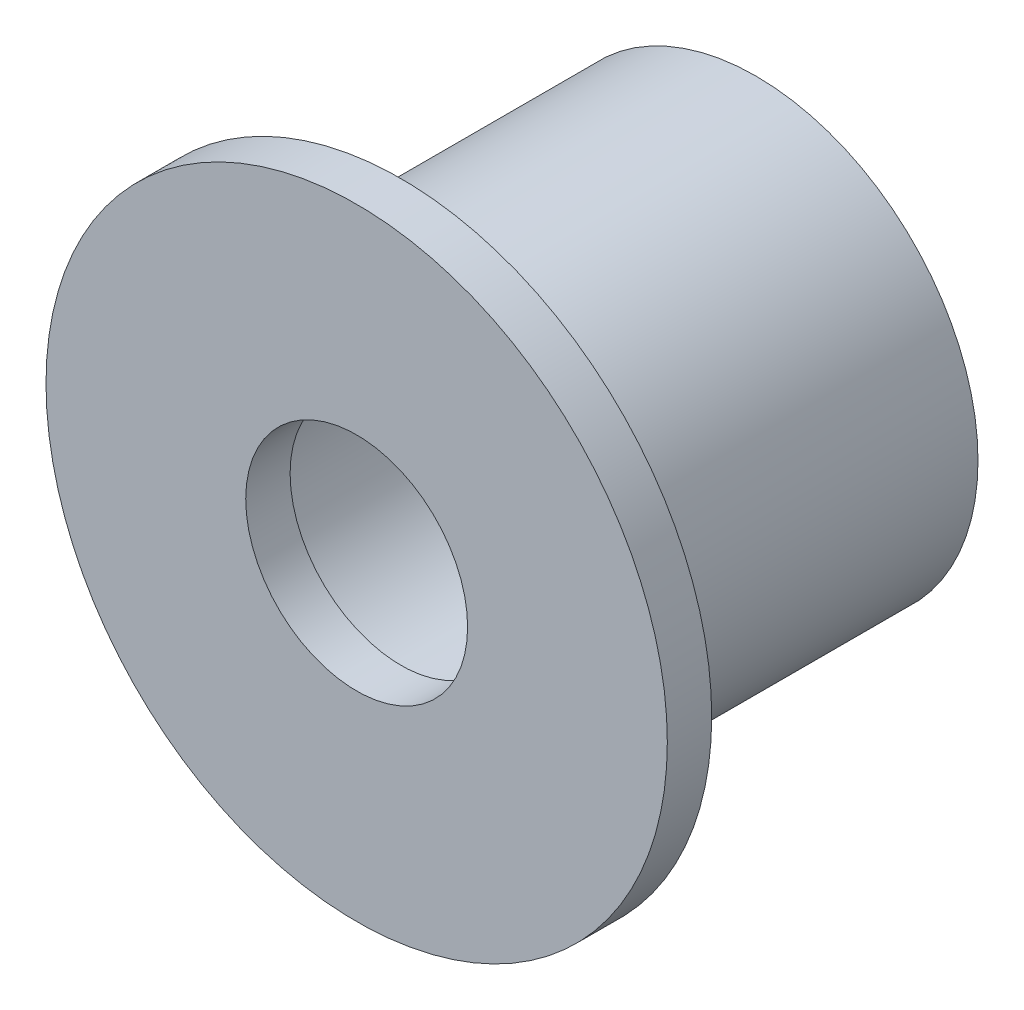
ISO-10303-21;
HEADER;
FILE_DESCRIPTION(('STEP AP214'),'2;1');
FILE_NAME('part.step','',(''),(''),'','','');
FILE_SCHEMA(('AUTOMOTIVE_DESIGN { 1 0 10303 214 1 1 1 1 }'));
ENDSEC;
DATA;
#1=APPLICATION_CONTEXT('core data for automotive mechanical design processes');
#2=APPLICATION_PROTOCOL_DEFINITION('international standard','automotive_design',2000,#1);
#3=PRODUCT_CONTEXT('',#1,'mechanical');
#4=PRODUCT('Part','Part','',(#3));
#5=PRODUCT_RELATED_PRODUCT_CATEGORY('part','',(#4));
#6=PRODUCT_DEFINITION_FORMATION('','',#4);
#7=PRODUCT_DEFINITION_CONTEXT('part definition',#1,'design');
#8=PRODUCT_DEFINITION('design','',#6,#7);
#9=PRODUCT_DEFINITION_SHAPE('','',#8);
#10=(LENGTH_UNIT() NAMED_UNIT(*) SI_UNIT(.MILLI.,.METRE.));
#11=(NAMED_UNIT(*) PLANE_ANGLE_UNIT() SI_UNIT($,.RADIAN.));
#12=(NAMED_UNIT(*) SI_UNIT($,.STERADIAN.) SOLID_ANGLE_UNIT());
#13=UNCERTAINTY_MEASURE_WITH_UNIT(LENGTH_MEASURE(1.E-05),#10,'distance_accuracy_value','');
#14=(GEOMETRIC_REPRESENTATION_CONTEXT(3) GLOBAL_UNCERTAINTY_ASSIGNED_CONTEXT((#13)) GLOBAL_UNIT_ASSIGNED_CONTEXT((#10,
#11,#12)) REPRESENTATION_CONTEXT('',''));
#15=CARTESIAN_POINT('',(0.,0.,0.));
#16=DIRECTION('',(0.,0.,1.));
#17=DIRECTION('',(1.,0.,0.));
#18=AXIS2_PLACEMENT_3D('',#15,#16,#17);
#19=CARTESIAN_POINT('',(0.,0.,0.));
#20=DIRECTION('',(0.,0.,1.));
#21=DIRECTION('',(1.,0.,0.));
#22=AXIS2_PLACEMENT_3D('',#19,#20,#21);
#23=PLANE('',#22);
#24=CARTESIAN_POINT('',(0.,0.,0.));
#25=DIRECTION('',(0.,0.,1.));
#26=DIRECTION('',(1.,0.,0.));
#27=AXIS2_PLACEMENT_3D('',#24,#25,#26);
#28=CIRCLE('',#27,2.5);
#29=CARTESIAN_POINT('',(2.5,0.,0.));
#30=VERTEX_POINT('',#29);
#31=EDGE_CURVE('E55',#30,#30,#28,.T.);
#32=ORIENTED_EDGE('',*,*,#31,.T.);
#33=EDGE_LOOP('',(#32));
#34=FACE_BOUND('',#33,.T.);
#35=CARTESIAN_POINT('',(0.,0.,0.));
#36=DIRECTION('',(0.,0.,-1.));
#37=DIRECTION('',(-1.,0.,0.));
#38=AXIS2_PLACEMENT_3D('',#35,#36,#37);
#39=CIRCLE('',#38,3.);
#40=CARTESIAN_POINT('',(-3.,0.,0.));
#41=VERTEX_POINT('',#40);
#42=EDGE_CURVE('E64',#41,#41,#39,.T.);
#43=ORIENTED_EDGE('',*,*,#42,.T.);
#44=EDGE_LOOP('',(#43));
#45=FACE_BOUND('',#44,.T.);
#46=ADVANCED_FACE('F37',(#34,#45),#23,.F.);
#47=CARTESIAN_POINT('',(0.,0.,1.));
#48=DIRECTION('',(0.,0.,1.));
#49=DIRECTION('',(1.,0.,0.));
#50=AXIS2_PLACEMENT_3D('',#47,#48,#49);
#51=PLANE('',#50);
#52=CARTESIAN_POINT('',(0.,0.,1.));
#53=DIRECTION('',(0.,0.,1.));
#54=DIRECTION('',(1.,0.,0.));
#55=AXIS2_PLACEMENT_3D('',#52,#53,#54);
#56=CIRCLE('',#55,7.);
#57=CARTESIAN_POINT('',(7.,0.,1.));
#58=VERTEX_POINT('',#57);
#59=EDGE_CURVE('E44',#58,#58,#56,.T.);
#60=ORIENTED_EDGE('',*,*,#59,.T.);
#61=EDGE_LOOP('',(#60));
#62=FACE_BOUND('',#61,.T.);
#63=CARTESIAN_POINT('',(0.,0.,1.));
#64=DIRECTION('',(0.,0.,1.));
#65=DIRECTION('',(1.,0.,0.));
#66=AXIS2_PLACEMENT_3D('',#63,#64,#65);
#67=CIRCLE('',#66,2.5);
#68=CARTESIAN_POINT('',(2.5,0.,1.));
#69=VERTEX_POINT('',#68);
#70=EDGE_CURVE('E53',#69,#69,#67,.T.);
#71=ORIENTED_EDGE('',*,*,#70,.F.);
#72=EDGE_LOOP('',(#71));
#73=FACE_BOUND('',#72,.T.);
#74=ADVANCED_FACE('F90',(#62,#73),#51,.T.);
#75=CARTESIAN_POINT('',(0.,0.,0.));
#76=DIRECTION('',(0.,0.,1.));
#77=DIRECTION('',(1.,0.,0.));
#78=AXIS2_PLACEMENT_3D('',#75,#76,#77);
#79=CIRCLE('',#78,5.);
#80=CARTESIAN_POINT('',(5.,0.,0.));
#81=VERTEX_POINT('',#80);
#82=EDGE_CURVE('E10',#81,#81,#79,.F.);
#83=ORIENTED_EDGE('',*,*,#82,.F.);
#84=EDGE_LOOP('',(#83));
#85=FACE_BOUND('',#84,.T.);
#86=CARTESIAN_POINT('',(0.,0.,0.));
#87=DIRECTION('',(0.,0.,1.));
#88=DIRECTION('',(1.,0.,0.));
#89=AXIS2_PLACEMENT_3D('',#86,#87,#88);
#90=CIRCLE('',#89,7.);
#91=CARTESIAN_POINT('',(7.,0.,0.));
#92=VERTEX_POINT('',#91);
#93=EDGE_CURVE('E48',#92,#92,#90,.T.);
#94=ORIENTED_EDGE('',*,*,#93,.F.);
#95=EDGE_LOOP('',(#94));
#96=FACE_BOUND('',#95,.T.);
#97=ADVANCED_FACE('F92',(#85,#96),#23,.F.);
#98=CARTESIAN_POINT('',(0.,0.,1.));
#99=DIRECTION('',(0.,0.,-1.));
#100=DIRECTION('',(-1.,0.,0.));
#101=AXIS2_PLACEMENT_3D('',#98,#99,#100);
#102=CYLINDRICAL_SURFACE('',#101,7.);
#103=ORIENTED_EDGE('',*,*,#59,.F.);
#104=EDGE_LOOP('',(#103));
#105=FACE_BOUND('',#104,.T.);
#106=ORIENTED_EDGE('',*,*,#93,.T.);
#107=EDGE_LOOP('',(#106));
#108=FACE_BOUND('',#107,.T.);
#109=ADVANCED_FACE('F39',(#105,#108),#102,.T.);
#110=CARTESIAN_POINT('',(0.,0.,1.));
#111=DIRECTION('',(0.,0.,-1.));
#112=DIRECTION('',(-1.,0.,0.));
#113=AXIS2_PLACEMENT_3D('',#110,#111,#112);
#114=CYLINDRICAL_SURFACE('',#113,2.5);
#115=ORIENTED_EDGE('',*,*,#70,.T.);
#116=EDGE_LOOP('',(#115));
#117=FACE_BOUND('',#116,.T.);
#118=ORIENTED_EDGE('',*,*,#31,.F.);
#119=EDGE_LOOP('',(#118));
#120=FACE_BOUND('',#119,.T.);
#121=ADVANCED_FACE('F76',(#117,#120),#114,.F.);
#122=CARTESIAN_POINT('',(0.,0.,-8.));
#123=DIRECTION('',(0.,0.,-1.));
#124=DIRECTION('',(-1.,0.,0.));
#125=AXIS2_PLACEMENT_3D('',#122,#123,#124);
#126=PLANE('',#125);
#127=CARTESIAN_POINT('',(0.,0.,-8.));
#128=DIRECTION('',(0.,0.,-1.));
#129=DIRECTION('',(-1.,0.,0.));
#130=AXIS2_PLACEMENT_3D('',#127,#128,#129);
#131=CIRCLE('',#130,5.);
#132=CARTESIAN_POINT('',(-5.,0.,-8.));
#133=VERTEX_POINT('',#132);
#134=EDGE_CURVE('E58',#133,#133,#131,.T.);
#135=ORIENTED_EDGE('',*,*,#134,.T.);
#136=EDGE_LOOP('',(#135));
#137=FACE_BOUND('',#136,.T.);
#138=CARTESIAN_POINT('',(0.,0.,-8.));
#139=DIRECTION('',(0.,0.,-1.));
#140=DIRECTION('',(-1.,0.,0.));
#141=AXIS2_PLACEMENT_3D('',#138,#139,#140);
#142=CIRCLE('',#141,3.);
#143=CARTESIAN_POINT('',(-3.,0.,-8.));
#144=VERTEX_POINT('',#143);
#145=EDGE_CURVE('E63',#144,#144,#142,.T.);
#146=ORIENTED_EDGE('',*,*,#145,.F.);
#147=EDGE_LOOP('',(#146));
#148=FACE_BOUND('',#147,.T.);
#149=ADVANCED_FACE('F73',(#137,#148),#126,.T.);
#150=CARTESIAN_POINT('',(0.,0.,-8.));
#151=DIRECTION('',(0.,0.,1.));
#152=DIRECTION('',(1.,0.,0.));
#153=AXIS2_PLACEMENT_3D('',#150,#151,#152);
#154=CYLINDRICAL_SURFACE('',#153,5.);
#155=ORIENTED_EDGE('',*,*,#134,.F.);
#156=EDGE_LOOP('',(#155));
#157=FACE_BOUND('',#156,.T.);
#158=ORIENTED_EDGE('',*,*,#82,.T.);
#159=EDGE_LOOP('',(#158));
#160=FACE_BOUND('',#159,.T.);
#161=ADVANCED_FACE('F75',(#157,#160),#154,.T.);
#162=CARTESIAN_POINT('',(0.,0.,-8.));
#163=DIRECTION('',(0.,0.,1.));
#164=DIRECTION('',(1.,0.,0.));
#165=AXIS2_PLACEMENT_3D('',#162,#163,#164);
#166=CYLINDRICAL_SURFACE('',#165,3.);
#167=ORIENTED_EDGE('',*,*,#145,.T.);
#168=EDGE_LOOP('',(#167));
#169=FACE_BOUND('',#168,.T.);
#170=ORIENTED_EDGE('',*,*,#42,.F.);
#171=EDGE_LOOP('',(#170));
#172=FACE_BOUND('',#171,.T.);
#173=ADVANCED_FACE('F70',(#169,#172),#166,.F.);
#174=CLOSED_SHELL('',(#46,#74,#97,#109,#121,#149,#161,#173));
#175=MANIFOLD_SOLID_BREP('B2',#174);
#176=ADVANCED_BREP_SHAPE_REPRESENTATION('',(#18,#175),#14);
#177=SHAPE_DEFINITION_REPRESENTATION(#9,#176);
ENDSEC;
END-ISO-10303-21;
